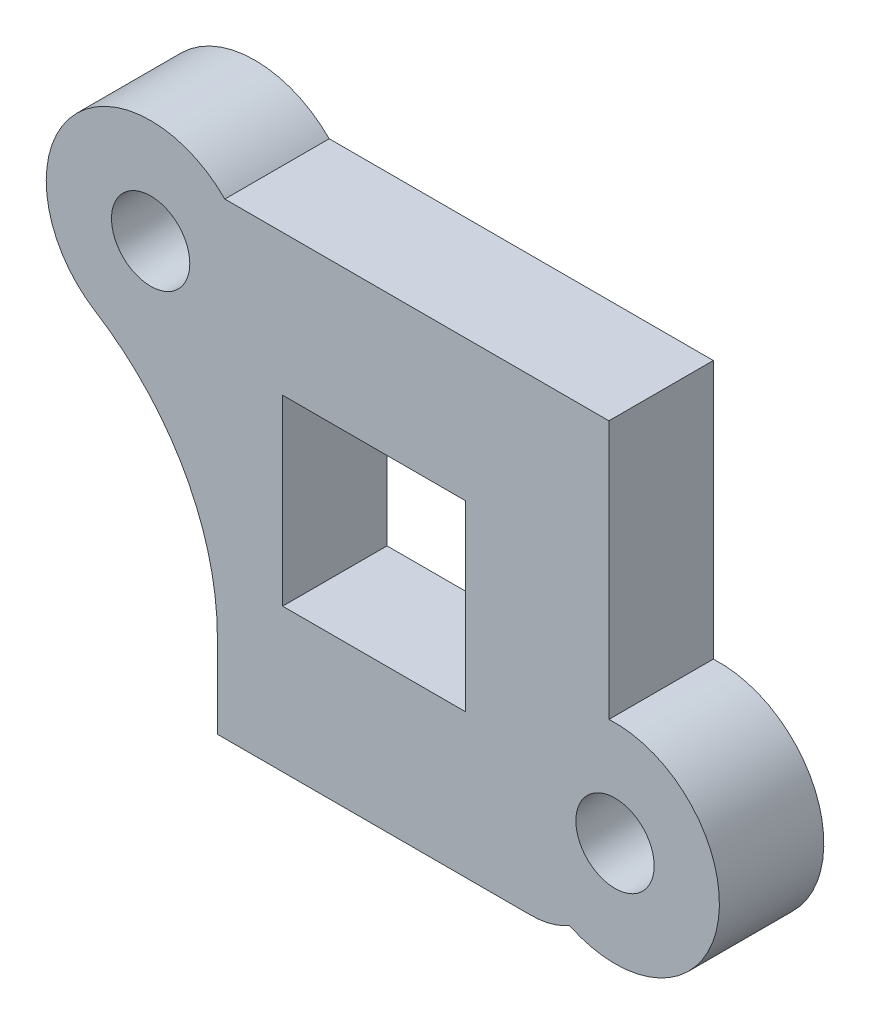
ISO-10303-21;
HEADER;
FILE_DESCRIPTION(('STEP AP214'),'2;1');
FILE_NAME('part.step','',(''),(''),'','','');
FILE_SCHEMA(('AUTOMOTIVE_DESIGN { 1 0 10303 214 1 1 1 1 }'));
ENDSEC;
DATA;
#1=APPLICATION_CONTEXT('core data for automotive mechanical design processes');
#2=APPLICATION_PROTOCOL_DEFINITION('international standard','automotive_design',2000,#1);
#3=PRODUCT_CONTEXT('',#1,'mechanical');
#4=PRODUCT('Part','Part','',(#3));
#5=PRODUCT_RELATED_PRODUCT_CATEGORY('part','',(#4));
#6=PRODUCT_DEFINITION_FORMATION('','',#4);
#7=PRODUCT_DEFINITION_CONTEXT('part definition',#1,'design');
#8=PRODUCT_DEFINITION('design','',#6,#7);
#9=PRODUCT_DEFINITION_SHAPE('','',#8);
#10=(LENGTH_UNIT() NAMED_UNIT(*) SI_UNIT(.MILLI.,.METRE.));
#11=(NAMED_UNIT(*) PLANE_ANGLE_UNIT() SI_UNIT($,.RADIAN.));
#12=(NAMED_UNIT(*) SI_UNIT($,.STERADIAN.) SOLID_ANGLE_UNIT());
#13=UNCERTAINTY_MEASURE_WITH_UNIT(LENGTH_MEASURE(1.E-05),#10,'distance_accuracy_value','');
#14=(GEOMETRIC_REPRESENTATION_CONTEXT(3) GLOBAL_UNCERTAINTY_ASSIGNED_CONTEXT((#13)) GLOBAL_UNIT_ASSIGNED_CONTEXT((#10,
#11,#12)) REPRESENTATION_CONTEXT('',''));
#15=CARTESIAN_POINT('',(0.,0.,0.));
#16=DIRECTION('',(0.,0.,1.));
#17=DIRECTION('',(1.,0.,0.));
#18=AXIS2_PLACEMENT_3D('',#15,#16,#17);
#19=CARTESIAN_POINT('',(7.73309265630969,-4.43679393288533,4.));
#20=DIRECTION('',(0.,0.,1.));
#21=DIRECTION('',(1.,0.,0.));
#22=AXIS2_PLACEMENT_3D('',#19,#20,#21);
#23=PLANE('',#22);
#24=CARTESIAN_POINT('',(4.5,-5.43679393288533,4.));
#25=DIRECTION('',(0.,0.,1.));
#26=DIRECTION('',(-1.,0.,0.));
#27=AXIS2_PLACEMENT_3D('',#24,#25,#26);
#28=CIRCLE('',#27,3.);
#29=CARTESIAN_POINT('',(4.5,-8.43679393288533,4.));
#30=VERTEX_POINT('',#29);
#31=CARTESIAN_POINT('',(5.99340500416617,-8.0386666226093,4.));
#32=VERTEX_POINT('',#31);
#33=EDGE_CURVE('E141',#30,#32,#28,.T.);
#34=ORIENTED_EDGE('',*,*,#33,.T.);
#35=CARTESIAN_POINT('',(7.73309265630969,-4.43679393288533,4.));
#36=DIRECTION('',(0.,0.,1.));
#37=DIRECTION('',(1.,0.,0.));
#38=AXIS2_PLACEMENT_3D('',#35,#36,#37);
#39=CIRCLE('',#38,4.);
#40=CARTESIAN_POINT('',(7.5,-0.443591231597246,4.));
#41=VERTEX_POINT('',#40);
#42=EDGE_CURVE('E194',#32,#41,#39,.T.);
#43=ORIENTED_EDGE('',*,*,#42,.T.);
#44=DIRECTION('',(0.,1.,0.));
#45=VECTOR('',#44,1.);
#46=CARTESIAN_POINT('',(7.5,-0.443591231597246,4.));
#47=LINE('',#46,#45);
#48=CARTESIAN_POINT('',(7.5,9.46320606711467,4.));
#49=VERTEX_POINT('',#48);
#50=EDGE_CURVE('E196',#41,#49,#47,.T.);
#51=ORIENTED_EDGE('',*,*,#50,.T.);
#52=DIRECTION('',(-1.,0.,0.));
#53=VECTOR('',#52,1.);
#54=CARTESIAN_POINT('',(7.5,9.46320606711467,4.));
#55=LINE('',#54,#53);
#56=CARTESIAN_POINT('',(-7.21473133025104,9.46320606711467,4.));
#57=VERTEX_POINT('',#56);
#58=EDGE_CURVE('E199',#49,#57,#55,.T.);
#59=ORIENTED_EDGE('',*,*,#58,.T.);
#60=CARTESIAN_POINT('',(-10.0568181818182,6.6485049589774,4.));
#61=DIRECTION('',(0.,0.,1.));
#62=DIRECTION('',(1.,0.,0.));
#63=AXIS2_PLACEMENT_3D('',#60,#61,#62);
#64=CIRCLE('',#63,4.);
#65=CARTESIAN_POINT('',(-12.1834415584416,3.26066301844963,4.));
#66=VERTEX_POINT('',#65);
#67=EDGE_CURVE('E201',#57,#66,#64,.T.);
#68=ORIENTED_EDGE('',*,*,#67,.T.);
#69=CARTESIAN_POINT('',(-17.5,-5.20894183286981,4.));
#70=DIRECTION('',(0.,0.,1.));
#71=DIRECTION('',(1.,0.,0.));
#72=AXIS2_PLACEMENT_3D('',#69,#70,#71);
#73=CIRCLE('',#72,10.);
#74=CARTESIAN_POINT('',(-7.5,-5.20894183286981,4.));
#75=VERTEX_POINT('',#74);
#76=EDGE_CURVE('E226',#66,#75,#73,.F.);
#77=ORIENTED_EDGE('',*,*,#76,.T.);
#78=DIRECTION('',(0.,-1.,0.));
#79=VECTOR('',#78,1.);
#80=CARTESIAN_POINT('',(-7.5,-9.46320606711467,4.));
#81=LINE('',#80,#79);
#82=CARTESIAN_POINT('',(-7.5,-8.43679393288533,4.));
#83=VERTEX_POINT('',#82);
#84=EDGE_CURVE('E148',#75,#83,#81,.T.);
#85=ORIENTED_EDGE('',*,*,#84,.T.);
#86=DIRECTION('',(1.,0.,0.));
#87=VECTOR('',#86,1.);
#88=CARTESIAN_POINT('',(-7.5,-8.43679393288533,4.));
#89=LINE('',#88,#87);
#90=EDGE_CURVE('E129',#83,#30,#89,.T.);
#91=ORIENTED_EDGE('',*,*,#90,.T.);
#92=EDGE_LOOP('',(#34,#43,#51,#59,#68,#77,#85,#91));
#93=FACE_BOUND('',#92,.T.);
#94=CARTESIAN_POINT('',(7.73309265630969,-4.43679393288533,4.));
#95=DIRECTION('',(0.,0.,1.));
#96=DIRECTION('',(1.,0.,0.));
#97=AXIS2_PLACEMENT_3D('',#94,#95,#96);
#98=CIRCLE('',#97,1.5);
#99=CARTESIAN_POINT('',(9.23309265630969,-4.43679393288533,4.));
#100=VERTEX_POINT('',#99);
#101=EDGE_CURVE('E159',#100,#100,#98,.T.);
#102=ORIENTED_EDGE('',*,*,#101,.F.);
#103=EDGE_LOOP('',(#102));
#104=FACE_BOUND('',#103,.T.);
#105=DIRECTION('',(1.,0.,0.));
#106=VECTOR('',#105,1.);
#107=CARTESIAN_POINT('',(-5.,-2.93679393288533,4.));
#108=LINE('',#107,#106);
#109=CARTESIAN_POINT('',(-5.,-2.93679393288533,4.));
#110=VERTEX_POINT('',#109);
#111=CARTESIAN_POINT('',(2.,-2.93679393288533,4.));
#112=VERTEX_POINT('',#111);
#113=EDGE_CURVE('E165',#110,#112,#108,.T.);
#114=ORIENTED_EDGE('',*,*,#113,.F.);
#115=DIRECTION('',(0.,-1.,0.));
#116=VECTOR('',#115,1.);
#117=CARTESIAN_POINT('',(-5.,-2.93679393288533,4.));
#118=LINE('',#117,#116);
#119=CARTESIAN_POINT('',(-5.,4.06320606711467,4.));
#120=VERTEX_POINT('',#119);
#121=EDGE_CURVE('E163',#120,#110,#118,.T.);
#122=ORIENTED_EDGE('',*,*,#121,.F.);
#123=DIRECTION('',(-1.,0.,0.));
#124=VECTOR('',#123,1.);
#125=CARTESIAN_POINT('',(-5.,4.06320606711467,4.));
#126=LINE('',#125,#124);
#127=CARTESIAN_POINT('',(2.,4.06320606711467,4.));
#128=VERTEX_POINT('',#127);
#129=EDGE_CURVE('E171',#128,#120,#126,.T.);
#130=ORIENTED_EDGE('',*,*,#129,.F.);
#131=DIRECTION('',(0.,1.,0.));
#132=VECTOR('',#131,1.);
#133=CARTESIAN_POINT('',(2.,-2.93679393288533,4.));
#134=LINE('',#133,#132);
#135=EDGE_CURVE('E168',#112,#128,#134,.T.);
#136=ORIENTED_EDGE('',*,*,#135,.F.);
#137=EDGE_LOOP('',(#114,#122,#130,#136));
#138=FACE_BOUND('',#137,.T.);
#139=CARTESIAN_POINT('',(-10.0568181818182,6.6485049589774,4.));
#140=DIRECTION('',(0.,0.,1.));
#141=DIRECTION('',(1.,0.,0.));
#142=AXIS2_PLACEMENT_3D('',#139,#140,#141);
#143=CIRCLE('',#142,1.5);
#144=CARTESIAN_POINT('',(-8.55681818181818,6.6485049589774,4.));
#145=VERTEX_POINT('',#144);
#146=EDGE_CURVE('E154',#145,#145,#143,.T.);
#147=ORIENTED_EDGE('',*,*,#146,.F.);
#148=EDGE_LOOP('',(#147));
#149=FACE_BOUND('',#148,.T.);
#150=ADVANCED_FACE('F33',(#93,#104,#138,#149),#23,.T.);
#151=CARTESIAN_POINT('',(7.73309265630969,-4.43679393288533,0.));
#152=DIRECTION('',(0.,0.,1.));
#153=DIRECTION('',(1.,0.,0.));
#154=AXIS2_PLACEMENT_3D('',#151,#152,#153);
#155=PLANE('',#154);
#156=CARTESIAN_POINT('',(-10.0568181818182,6.6485049589774,0.));
#157=DIRECTION('',(0.,0.,1.));
#158=DIRECTION('',(1.,0.,0.));
#159=AXIS2_PLACEMENT_3D('',#156,#157,#158);
#160=CIRCLE('',#159,3.);
#161=CARTESIAN_POINT('',(-7.05681818181819,6.6485049589774,0.));
#162=VERTEX_POINT('',#161);
#163=EDGE_CURVE('E231',#162,#162,#160,.T.);
#164=ORIENTED_EDGE('',*,*,#163,.T.);
#165=EDGE_LOOP('',(#164));
#166=FACE_BOUND('',#165,.T.);
#167=CARTESIAN_POINT('',(7.73309265630969,-4.43679393288533,0.));
#168=DIRECTION('',(0.,0.,1.));
#169=DIRECTION('',(1.,0.,0.));
#170=AXIS2_PLACEMENT_3D('',#167,#168,#169);
#171=CIRCLE('',#170,3.);
#172=CARTESIAN_POINT('',(10.7330926563097,-4.43679393288533,0.));
#173=VERTEX_POINT('',#172);
#174=EDGE_CURVE('E228',#173,#173,#171,.T.);
#175=ORIENTED_EDGE('',*,*,#174,.T.);
#176=EDGE_LOOP('',(#175));
#177=FACE_BOUND('',#176,.T.);
#178=CARTESIAN_POINT('',(7.73309265630969,-4.43679393288533,0.));
#179=DIRECTION('',(0.,0.,1.));
#180=DIRECTION('',(1.,0.,0.));
#181=AXIS2_PLACEMENT_3D('',#178,#179,#180);
#182=CIRCLE('',#181,4.);
#183=CARTESIAN_POINT('',(5.99340500416617,-8.0386666226093,0.));
#184=VERTEX_POINT('',#183);
#185=CARTESIAN_POINT('',(7.5,-0.443591231597246,0.));
#186=VERTEX_POINT('',#185);
#187=EDGE_CURVE('E193',#184,#186,#182,.T.);
#188=ORIENTED_EDGE('',*,*,#187,.F.);
#189=CARTESIAN_POINT('',(4.5,-5.43679393288533,0.));
#190=DIRECTION('',(0.,0.,1.));
#191=DIRECTION('',(-1.,0.,0.));
#192=AXIS2_PLACEMENT_3D('',#189,#190,#191);
#193=CIRCLE('',#192,3.);
#194=CARTESIAN_POINT('',(4.5,-8.43679393288533,0.));
#195=VERTEX_POINT('',#194);
#196=EDGE_CURVE('E149',#195,#184,#193,.T.);
#197=ORIENTED_EDGE('',*,*,#196,.F.);
#198=DIRECTION('',(1.,0.,0.));
#199=VECTOR('',#198,1.);
#200=CARTESIAN_POINT('',(-7.5,-8.43679393288533,0.));
#201=LINE('',#200,#199);
#202=CARTESIAN_POINT('',(-7.5,-8.43679393288533,0.));
#203=VERTEX_POINT('',#202);
#204=EDGE_CURVE('E132',#203,#195,#201,.T.);
#205=ORIENTED_EDGE('',*,*,#204,.F.);
#206=DIRECTION('',(0.,-1.,0.));
#207=VECTOR('',#206,1.);
#208=CARTESIAN_POINT('',(-7.5,-9.46320606711467,0.));
#209=LINE('',#208,#207);
#210=CARTESIAN_POINT('',(-7.5,-5.20894183286981,0.));
#211=VERTEX_POINT('',#210);
#212=EDGE_CURVE('E197',#211,#203,#209,.T.);
#213=ORIENTED_EDGE('',*,*,#212,.F.);
#214=CARTESIAN_POINT('',(-17.5,-5.20894183286981,0.));
#215=DIRECTION('',(0.,0.,1.));
#216=DIRECTION('',(1.,0.,0.));
#217=AXIS2_PLACEMENT_3D('',#214,#215,#216);
#218=CIRCLE('',#217,10.);
#219=CARTESIAN_POINT('',(-12.1834415584416,3.26066301844963,0.));
#220=VERTEX_POINT('',#219);
#221=EDGE_CURVE('E56',#211,#220,#218,.T.);
#222=ORIENTED_EDGE('',*,*,#221,.T.);
#223=CARTESIAN_POINT('',(-10.0568181818182,6.6485049589774,0.));
#224=DIRECTION('',(0.,0.,1.));
#225=DIRECTION('',(1.,0.,0.));
#226=AXIS2_PLACEMENT_3D('',#223,#224,#225);
#227=CIRCLE('',#226,4.);
#228=CARTESIAN_POINT('',(-7.21473133025104,9.46320606711467,0.));
#229=VERTEX_POINT('',#228);
#230=EDGE_CURVE('E210',#229,#220,#227,.T.);
#231=ORIENTED_EDGE('',*,*,#230,.F.);
#232=DIRECTION('',(-1.,0.,0.));
#233=VECTOR('',#232,1.);
#234=CARTESIAN_POINT('',(7.5,9.46320606711467,0.));
#235=LINE('',#234,#233);
#236=CARTESIAN_POINT('',(7.5,9.46320606711467,0.));
#237=VERTEX_POINT('',#236);
#238=EDGE_CURVE('E208',#237,#229,#235,.T.);
#239=ORIENTED_EDGE('',*,*,#238,.F.);
#240=DIRECTION('',(0.,1.,0.));
#241=VECTOR('',#240,1.);
#242=CARTESIAN_POINT('',(7.5,-0.443591231597246,0.));
#243=LINE('',#242,#241);
#244=EDGE_CURVE('E206',#186,#237,#243,.T.);
#245=ORIENTED_EDGE('',*,*,#244,.F.);
#246=EDGE_LOOP('',(#188,#197,#205,#213,#222,#231,#239,#245));
#247=FACE_BOUND('',#246,.T.);
#248=DIRECTION('',(0.,-1.,0.));
#249=VECTOR('',#248,1.);
#250=CARTESIAN_POINT('',(-5.,-2.93679393288533,0.));
#251=LINE('',#250,#249);
#252=CARTESIAN_POINT('',(-5.,4.06320606711467,0.));
#253=VERTEX_POINT('',#252);
#254=CARTESIAN_POINT('',(-5.,-2.93679393288533,0.));
#255=VERTEX_POINT('',#254);
#256=EDGE_CURVE('E162',#253,#255,#251,.T.);
#257=ORIENTED_EDGE('',*,*,#256,.T.);
#258=DIRECTION('',(1.,0.,0.));
#259=VECTOR('',#258,1.);
#260=CARTESIAN_POINT('',(-5.,-2.93679393288533,0.));
#261=LINE('',#260,#259);
#262=CARTESIAN_POINT('',(2.,-2.93679393288533,0.));
#263=VERTEX_POINT('',#262);
#264=EDGE_CURVE('E176',#255,#263,#261,.T.);
#265=ORIENTED_EDGE('',*,*,#264,.T.);
#266=DIRECTION('',(0.,1.,0.));
#267=VECTOR('',#266,1.);
#268=CARTESIAN_POINT('',(2.,-2.93679393288533,0.));
#269=LINE('',#268,#267);
#270=CARTESIAN_POINT('',(2.,4.06320606711467,0.));
#271=VERTEX_POINT('',#270);
#272=EDGE_CURVE('E179',#263,#271,#269,.T.);
#273=ORIENTED_EDGE('',*,*,#272,.T.);
#274=DIRECTION('',(-1.,0.,0.));
#275=VECTOR('',#274,1.);
#276=CARTESIAN_POINT('',(-5.,4.06320606711467,0.));
#277=LINE('',#276,#275);
#278=EDGE_CURVE('E166',#271,#253,#277,.T.);
#279=ORIENTED_EDGE('',*,*,#278,.T.);
#280=EDGE_LOOP('',(#257,#265,#273,#279));
#281=FACE_BOUND('',#280,.T.);
#282=ADVANCED_FACE('F245',(#166,#177,#247,#281),#155,.F.);
#283=CARTESIAN_POINT('',(7.73309265630969,-4.43679393288533,4.));
#284=DIRECTION('',(0.,0.,-1.));
#285=DIRECTION('',(-1.,0.,0.));
#286=AXIS2_PLACEMENT_3D('',#283,#284,#285);
#287=CYLINDRICAL_SURFACE('',#286,4.);
#288=ORIENTED_EDGE('',*,*,#187,.T.);
#289=DIRECTION('',(0.,0.,-1.));
#290=VECTOR('',#289,1.);
#291=CARTESIAN_POINT('',(7.5,-0.443591231597246,4.));
#292=LINE('',#291,#290);
#293=EDGE_CURVE('E218',#41,#186,#292,.T.);
#294=ORIENTED_EDGE('',*,*,#293,.F.);
#295=ORIENTED_EDGE('',*,*,#42,.F.);
#296=DIRECTION('',(0.,0.,-1.));
#297=VECTOR('',#296,1.);
#298=CARTESIAN_POINT('',(5.99340500416617,-8.0386666226093,4.));
#299=LINE('',#298,#297);
#300=EDGE_CURVE('E136',#32,#184,#299,.T.);
#301=ORIENTED_EDGE('',*,*,#300,.T.);
#302=EDGE_LOOP('',(#288,#294,#295,#301));
#303=FACE_BOUND('',#302,.T.);
#304=ADVANCED_FACE('F248',(#303),#287,.T.);
#305=CARTESIAN_POINT('',(7.5,-0.443591231597246,4.));
#306=DIRECTION('',(-1.,0.,0.));
#307=DIRECTION('',(0.,0.,1.));
#308=AXIS2_PLACEMENT_3D('',#305,#306,#307);
#309=PLANE('',#308);
#310=ORIENTED_EDGE('',*,*,#244,.T.);
#311=DIRECTION('',(0.,0.,-1.));
#312=VECTOR('',#311,1.);
#313=CARTESIAN_POINT('',(7.5,9.46320606711467,4.));
#314=LINE('',#313,#312);
#315=EDGE_CURVE('E215',#49,#237,#314,.T.);
#316=ORIENTED_EDGE('',*,*,#315,.F.);
#317=ORIENTED_EDGE('',*,*,#50,.F.);
#318=ORIENTED_EDGE('',*,*,#293,.T.);
#319=EDGE_LOOP('',(#310,#316,#317,#318));
#320=FACE_BOUND('',#319,.T.);
#321=ADVANCED_FACE('F297',(#320),#309,.F.);
#322=CARTESIAN_POINT('',(7.5,9.46320606711467,4.));
#323=DIRECTION('',(0.,-1.,0.));
#324=DIRECTION('',(0.,0.,-1.));
#325=AXIS2_PLACEMENT_3D('',#322,#323,#324);
#326=PLANE('',#325);
#327=ORIENTED_EDGE('',*,*,#238,.T.);
#328=DIRECTION('',(0.,0.,-1.));
#329=VECTOR('',#328,1.);
#330=CARTESIAN_POINT('',(-7.21473133025104,9.46320606711467,4.));
#331=LINE('',#330,#329);
#332=EDGE_CURVE('E204',#57,#229,#331,.T.);
#333=ORIENTED_EDGE('',*,*,#332,.F.);
#334=ORIENTED_EDGE('',*,*,#58,.F.);
#335=ORIENTED_EDGE('',*,*,#315,.T.);
#336=EDGE_LOOP('',(#327,#333,#334,#335));
#337=FACE_BOUND('',#336,.T.);
#338=ADVANCED_FACE('F294',(#337),#326,.F.);
#339=CARTESIAN_POINT('',(-10.0568181818182,6.6485049589774,4.));
#340=DIRECTION('',(0.,0.,-1.));
#341=DIRECTION('',(-1.,0.,0.));
#342=AXIS2_PLACEMENT_3D('',#339,#340,#341);
#343=CYLINDRICAL_SURFACE('',#342,4.);
#344=ORIENTED_EDGE('',*,*,#230,.T.);
#345=DIRECTION('',(0.,0.,-1.));
#346=VECTOR('',#345,1.);
#347=CARTESIAN_POINT('',(-12.1834415584416,3.26066301844963,4.));
#348=LINE('',#347,#346);
#349=EDGE_CURVE('E48',#220,#66,#348,.F.);
#350=ORIENTED_EDGE('',*,*,#349,.T.);
#351=ORIENTED_EDGE('',*,*,#67,.F.);
#352=ORIENTED_EDGE('',*,*,#332,.T.);
#353=EDGE_LOOP('',(#344,#350,#351,#352));
#354=FACE_BOUND('',#353,.T.);
#355=ADVANCED_FACE('F290',(#354),#343,.T.);
#356=CARTESIAN_POINT('',(-7.5,-9.46320606711467,4.));
#357=DIRECTION('',(1.,0.,0.));
#358=DIRECTION('',(0.,0.,-1.));
#359=AXIS2_PLACEMENT_3D('',#356,#357,#358);
#360=PLANE('',#359);
#361=ORIENTED_EDGE('',*,*,#84,.F.);
#362=DIRECTION('',(0.,0.,1.));
#363=VECTOR('',#362,1.);
#364=CARTESIAN_POINT('',(-7.5,-5.20894183286981,0.));
#365=LINE('',#364,#363);
#366=EDGE_CURVE('E221',#75,#211,#365,.F.);
#367=ORIENTED_EDGE('',*,*,#366,.T.);
#368=ORIENTED_EDGE('',*,*,#212,.T.);
#369=DIRECTION('',(0.,0.,-1.));
#370=VECTOR('',#369,1.);
#371=CARTESIAN_POINT('',(-7.5,-8.43679393288533,4.));
#372=LINE('',#371,#370);
#373=EDGE_CURVE('E137',#83,#203,#372,.T.);
#374=ORIENTED_EDGE('',*,*,#373,.F.);
#375=EDGE_LOOP('',(#361,#367,#368,#374));
#376=FACE_BOUND('',#375,.T.);
#377=ADVANCED_FACE('F287',(#376),#360,.F.);
#378=CARTESIAN_POINT('',(-5.,-2.93679393288533,4.));
#379=DIRECTION('',(1.,0.,0.));
#380=DIRECTION('',(0.,0.,-1.));
#381=AXIS2_PLACEMENT_3D('',#378,#379,#380);
#382=PLANE('',#381);
#383=ORIENTED_EDGE('',*,*,#256,.F.);
#384=DIRECTION('',(0.,0.,-1.));
#385=VECTOR('',#384,1.);
#386=CARTESIAN_POINT('',(-5.,4.06320606711467,4.));
#387=LINE('',#386,#385);
#388=EDGE_CURVE('E173',#120,#253,#387,.T.);
#389=ORIENTED_EDGE('',*,*,#388,.F.);
#390=ORIENTED_EDGE('',*,*,#121,.T.);
#391=DIRECTION('',(0.,0.,-1.));
#392=VECTOR('',#391,1.);
#393=CARTESIAN_POINT('',(-5.,-2.93679393288533,4.));
#394=LINE('',#393,#392);
#395=EDGE_CURVE('E190',#110,#255,#394,.T.);
#396=ORIENTED_EDGE('',*,*,#395,.T.);
#397=EDGE_LOOP('',(#383,#389,#390,#396));
#398=FACE_BOUND('',#397,.T.);
#399=ADVANCED_FACE('F256',(#398),#382,.T.);
#400=CARTESIAN_POINT('',(-5.,-2.93679393288533,4.));
#401=DIRECTION('',(0.,1.,0.));
#402=DIRECTION('',(0.,0.,1.));
#403=AXIS2_PLACEMENT_3D('',#400,#401,#402);
#404=PLANE('',#403);
#405=ORIENTED_EDGE('',*,*,#264,.F.);
#406=ORIENTED_EDGE('',*,*,#395,.F.);
#407=ORIENTED_EDGE('',*,*,#113,.T.);
#408=DIRECTION('',(0.,0.,-1.));
#409=VECTOR('',#408,1.);
#410=CARTESIAN_POINT('',(2.,-2.93679393288533,4.));
#411=LINE('',#410,#409);
#412=EDGE_CURVE('E188',#112,#263,#411,.T.);
#413=ORIENTED_EDGE('',*,*,#412,.T.);
#414=EDGE_LOOP('',(#405,#406,#407,#413));
#415=FACE_BOUND('',#414,.T.);
#416=ADVANCED_FACE('F267',(#415),#404,.T.);
#417=CARTESIAN_POINT('',(2.,-2.93679393288533,4.));
#418=DIRECTION('',(-1.,0.,0.));
#419=DIRECTION('',(0.,0.,1.));
#420=AXIS2_PLACEMENT_3D('',#417,#418,#419);
#421=PLANE('',#420);
#422=ORIENTED_EDGE('',*,*,#272,.F.);
#423=ORIENTED_EDGE('',*,*,#412,.F.);
#424=ORIENTED_EDGE('',*,*,#135,.T.);
#425=DIRECTION('',(0.,0.,-1.));
#426=VECTOR('',#425,1.);
#427=CARTESIAN_POINT('',(2.,4.06320606711467,4.));
#428=LINE('',#427,#426);
#429=EDGE_CURVE('E186',#128,#271,#428,.T.);
#430=ORIENTED_EDGE('',*,*,#429,.T.);
#431=EDGE_LOOP('',(#422,#423,#424,#430));
#432=FACE_BOUND('',#431,.T.);
#433=ADVANCED_FACE('F271',(#432),#421,.T.);
#434=CARTESIAN_POINT('',(-5.,4.06320606711467,4.));
#435=DIRECTION('',(0.,-1.,0.));
#436=DIRECTION('',(0.,0.,-1.));
#437=AXIS2_PLACEMENT_3D('',#434,#435,#436);
#438=PLANE('',#437);
#439=ORIENTED_EDGE('',*,*,#278,.F.);
#440=ORIENTED_EDGE('',*,*,#429,.F.);
#441=ORIENTED_EDGE('',*,*,#129,.T.);
#442=ORIENTED_EDGE('',*,*,#388,.T.);
#443=EDGE_LOOP('',(#439,#440,#441,#442));
#444=FACE_BOUND('',#443,.T.);
#445=ADVANCED_FACE('F260',(#444),#438,.T.);
#446=CARTESIAN_POINT('',(7.73309265630969,-4.43679393288533,4.));
#447=DIRECTION('',(0.,0.,-1.));
#448=DIRECTION('',(-1.,0.,0.));
#449=AXIS2_PLACEMENT_3D('',#446,#447,#448);
#450=CYLINDRICAL_SURFACE('',#449,1.5);
#451=CARTESIAN_POINT('',(7.73309265630969,-4.43679393288533,1.5));
#452=DIRECTION('',(0.,0.,1.));
#453=DIRECTION('',(1.,0.,0.));
#454=AXIS2_PLACEMENT_3D('',#451,#452,#453);
#455=CIRCLE('',#454,1.5);
#456=CARTESIAN_POINT('',(9.23309265630969,-4.43679393288533,1.5));
#457=VERTEX_POINT('',#456);
#458=EDGE_CURVE('E11',#457,#457,#455,.F.);
#459=ORIENTED_EDGE('',*,*,#458,.T.);
#460=EDGE_LOOP('',(#459));
#461=FACE_BOUND('',#460,.T.);
#462=ORIENTED_EDGE('',*,*,#101,.T.);
#463=EDGE_LOOP('',(#462));
#464=FACE_BOUND('',#463,.T.);
#465=ADVANCED_FACE('F278',(#461,#464),#450,.F.);
#466=CARTESIAN_POINT('',(-10.0568181818182,6.6485049589774,4.));
#467=DIRECTION('',(0.,0.,-1.));
#468=DIRECTION('',(-1.,0.,0.));
#469=AXIS2_PLACEMENT_3D('',#466,#467,#468);
#470=CYLINDRICAL_SURFACE('',#469,1.5);
#471=CARTESIAN_POINT('',(-10.0568181818182,6.6485049589774,1.5));
#472=DIRECTION('',(0.,0.,1.));
#473=DIRECTION('',(1.,0.,0.));
#474=AXIS2_PLACEMENT_3D('',#471,#472,#473);
#475=CIRCLE('',#474,1.5);
#476=CARTESIAN_POINT('',(-8.55681818181818,6.6485049589774,1.5));
#477=VERTEX_POINT('',#476);
#478=EDGE_CURVE('E41',#477,#477,#475,.F.);
#479=ORIENTED_EDGE('',*,*,#478,.T.);
#480=EDGE_LOOP('',(#479));
#481=FACE_BOUND('',#480,.T.);
#482=ORIENTED_EDGE('',*,*,#146,.T.);
#483=EDGE_LOOP('',(#482));
#484=FACE_BOUND('',#483,.T.);
#485=ADVANCED_FACE('F236',(#481,#484),#470,.F.);
#486=CARTESIAN_POINT('',(4.5,-5.43679393288533,4.));
#487=DIRECTION('',(0.,0.,-1.));
#488=DIRECTION('',(-1.,0.,0.));
#489=AXIS2_PLACEMENT_3D('',#486,#487,#488);
#490=CYLINDRICAL_SURFACE('',#489,3.);
#491=ORIENTED_EDGE('',*,*,#196,.T.);
#492=ORIENTED_EDGE('',*,*,#300,.F.);
#493=ORIENTED_EDGE('',*,*,#33,.F.);
#494=DIRECTION('',(0.,0.,-1.));
#495=VECTOR('',#494,1.);
#496=CARTESIAN_POINT('',(4.5,-8.43679393288533,4.));
#497=LINE('',#496,#495);
#498=EDGE_CURVE('E124',#30,#195,#497,.T.);
#499=ORIENTED_EDGE('',*,*,#498,.T.);
#500=EDGE_LOOP('',(#491,#492,#493,#499));
#501=FACE_BOUND('',#500,.T.);
#502=ADVANCED_FACE('F142',(#501),#490,.T.);
#503=CARTESIAN_POINT('',(-7.5,-8.43679393288533,4.));
#504=DIRECTION('',(0.,1.,0.));
#505=DIRECTION('',(0.,0.,1.));
#506=AXIS2_PLACEMENT_3D('',#503,#504,#505);
#507=PLANE('',#506);
#508=ORIENTED_EDGE('',*,*,#204,.T.);
#509=ORIENTED_EDGE('',*,*,#498,.F.);
#510=ORIENTED_EDGE('',*,*,#90,.F.);
#511=ORIENTED_EDGE('',*,*,#373,.T.);
#512=EDGE_LOOP('',(#508,#509,#510,#511));
#513=FACE_BOUND('',#512,.T.);
#514=ADVANCED_FACE('F126',(#513),#507,.F.);
#515=CARTESIAN_POINT('',(-17.5,-5.20894183286981,4.));
#516=DIRECTION('',(0.,0.,-1.));
#517=DIRECTION('',(-1.,0.,0.));
#518=AXIS2_PLACEMENT_3D('',#515,#516,#517);
#519=CYLINDRICAL_SURFACE('',#518,10.);
#520=ORIENTED_EDGE('',*,*,#76,.F.);
#521=ORIENTED_EDGE('',*,*,#349,.F.);
#522=ORIENTED_EDGE('',*,*,#221,.F.);
#523=ORIENTED_EDGE('',*,*,#366,.F.);
#524=EDGE_LOOP('',(#520,#521,#522,#523));
#525=FACE_BOUND('',#524,.T.);
#526=ADVANCED_FACE('F242',(#525),#519,.F.);
#527=CARTESIAN_POINT('',(-10.0568181818182,6.6485049589774,0.));
#528=DIRECTION('',(0.,0.,-1.));
#529=DIRECTION('',(-1.,0.,0.));
#530=AXIS2_PLACEMENT_3D('',#527,#528,#529);
#531=CONICAL_SURFACE('',#530,3.,0.785398163397445);
#532=ORIENTED_EDGE('',*,*,#478,.F.);
#533=EDGE_LOOP('',(#532));
#534=FACE_BOUND('',#533,.T.);
#535=ORIENTED_EDGE('',*,*,#163,.F.);
#536=EDGE_LOOP('',(#535));
#537=FACE_BOUND('',#536,.T.);
#538=ADVANCED_FACE('F239',(#534,#537),#531,.F.);
#539=CARTESIAN_POINT('',(7.73309265630969,-4.43679393288533,0.));
#540=DIRECTION('',(0.,0.,-1.));
#541=DIRECTION('',(-1.,0.,0.));
#542=AXIS2_PLACEMENT_3D('',#539,#540,#541);
#543=CONICAL_SURFACE('',#542,3.,0.785398163397445);
#544=ORIENTED_EDGE('',*,*,#458,.F.);
#545=EDGE_LOOP('',(#544));
#546=FACE_BOUND('',#545,.T.);
#547=ORIENTED_EDGE('',*,*,#174,.F.);
#548=EDGE_LOOP('',(#547));
#549=FACE_BOUND('',#548,.T.);
#550=ADVANCED_FACE('F35',(#546,#549),#543,.F.);
#551=CLOSED_SHELL('',(#150,#282,#304,#321,#338,#355,#377,#399,#416,#433,#445,#465,#485,#502,
#514,#526,#538,#550));
#552=MANIFOLD_SOLID_BREP('B2',#551);
#553=ADVANCED_BREP_SHAPE_REPRESENTATION('',(#18,#552),#14);
#554=SHAPE_DEFINITION_REPRESENTATION(#9,#553);
ENDSEC;
END-ISO-10303-21;
